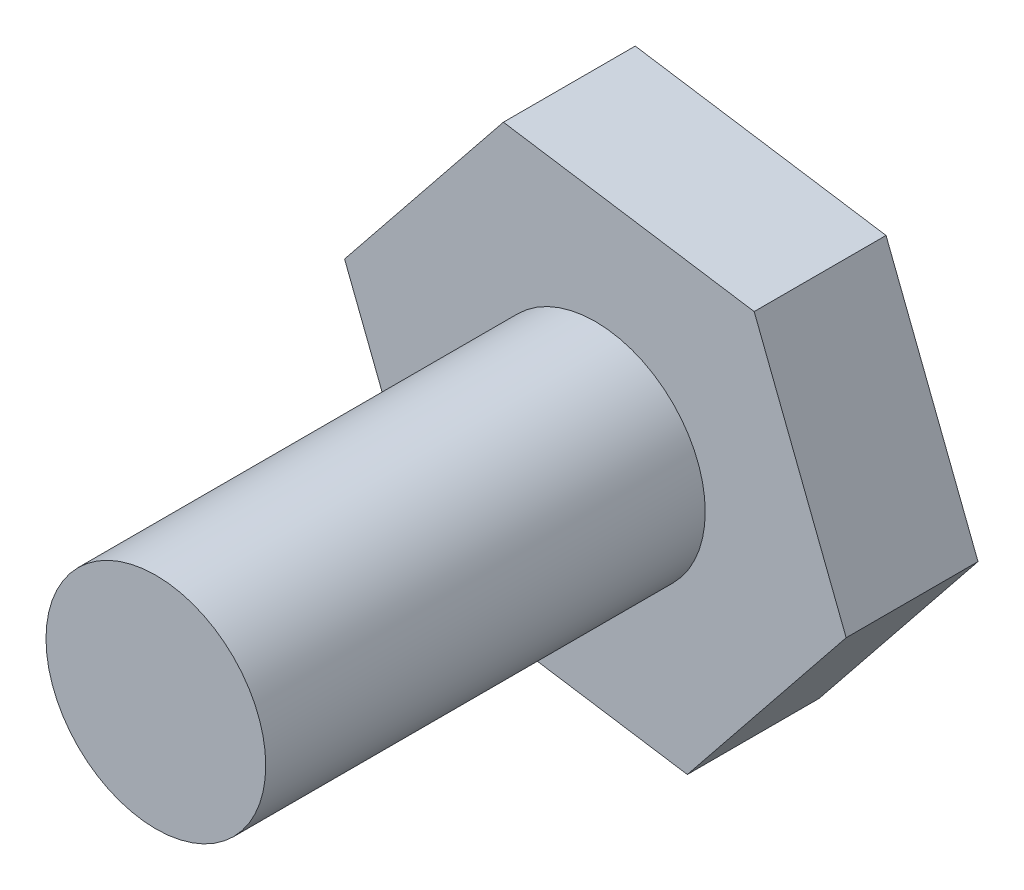
ISO-10303-21;
HEADER;
FILE_DESCRIPTION(('STEP AP214'),'2;1');
FILE_NAME('part.step','',(''),(''),'','','');
FILE_SCHEMA(('AUTOMOTIVE_DESIGN { 1 0 10303 214 1 1 1 1 }'));
ENDSEC;
DATA;
#1=APPLICATION_CONTEXT('core data for automotive mechanical design processes');
#2=APPLICATION_PROTOCOL_DEFINITION('international standard','automotive_design',2000,#1);
#3=PRODUCT_CONTEXT('',#1,'mechanical');
#4=PRODUCT('Part','Part','',(#3));
#5=PRODUCT_RELATED_PRODUCT_CATEGORY('part','',(#4));
#6=PRODUCT_DEFINITION_FORMATION('','',#4);
#7=PRODUCT_DEFINITION_CONTEXT('part definition',#1,'design');
#8=PRODUCT_DEFINITION('design','',#6,#7);
#9=PRODUCT_DEFINITION_SHAPE('','',#8);
#10=(LENGTH_UNIT() NAMED_UNIT(*) SI_UNIT(.MILLI.,.METRE.));
#11=(NAMED_UNIT(*) PLANE_ANGLE_UNIT() SI_UNIT($,.RADIAN.));
#12=(NAMED_UNIT(*) SI_UNIT($,.STERADIAN.) SOLID_ANGLE_UNIT());
#13=UNCERTAINTY_MEASURE_WITH_UNIT(LENGTH_MEASURE(1.E-05),#10,'distance_accuracy_value','');
#14=(GEOMETRIC_REPRESENTATION_CONTEXT(3) GLOBAL_UNCERTAINTY_ASSIGNED_CONTEXT((#13)) GLOBAL_UNIT_ASSIGNED_CONTEXT((#10,
#11,#12)) REPRESENTATION_CONTEXT('',''));
#15=CARTESIAN_POINT('',(0.,0.,0.));
#16=DIRECTION('',(0.,0.,1.));
#17=DIRECTION('',(1.,0.,0.));
#18=AXIS2_PLACEMENT_3D('',#15,#16,#17);
#19=CARTESIAN_POINT('',(0.,0.,3.));
#20=DIRECTION('',(0.,0.,1.));
#21=DIRECTION('',(1.,0.,0.));
#22=AXIS2_PLACEMENT_3D('',#19,#20,#21);
#23=PLANE('',#22);
#24=DIRECTION('',(0.98836285257801,-0.152114666103763,0.));
#25=VECTOR('',#24,1.);
#26=CARTESIAN_POINT('',(-60.0929519376663,5.17809821649077,3.));
#27=LINE('',#26,#25);
#28=CARTESIAN_POINT('',(-60.0929519376663,5.17809821649077,3.));
#29=VERTEX_POINT('',#28);
#30=CARTESIAN_POINT('',(-54.3866363477368,4.2998637822638,3.));
#31=VERTEX_POINT('',#30);
#32=EDGE_CURVE('E129',#29,#31,#27,.T.);
#33=ORIENTED_EDGE('',*,*,#32,.T.);
#34=DIRECTION('',(0.625916591423051,0.779890005437529,0.));
#35=VECTOR('',#34,1.);
#36=CARTESIAN_POINT('',(-54.3866363477368,4.2998637822638,3.));
#37=LINE('',#36,#35);
#38=CARTESIAN_POINT('',(-50.7729052222533,8.80256082804037,3.));
#39=VERTEX_POINT('',#38);
#40=EDGE_CURVE('E87',#31,#39,#37,.T.);
#41=ORIENTED_EDGE('',*,*,#40,.T.);
#42=DIRECTION('',(-0.362446261154959,0.932004671541292,0.));
#43=VECTOR('',#42,1.);
#44=CARTESIAN_POINT('',(-50.7729052222533,8.80256082804037,3.));
#45=LINE('',#44,#43);
#46=CARTESIAN_POINT('',(-52.8654896866992,14.1834923080439,3.));
#47=VERTEX_POINT('',#46);
#48=EDGE_CURVE('E100',#39,#47,#45,.T.);
#49=ORIENTED_EDGE('',*,*,#48,.T.);
#50=DIRECTION('',(-0.98836285257801,0.152114666103762,0.));
#51=VECTOR('',#50,1.);
#52=CARTESIAN_POINT('',(-52.8654896866992,14.1834923080439,3.));
#53=LINE('',#52,#51);
#54=CARTESIAN_POINT('',(-58.5718052766286,15.0617267422709,3.));
#55=VERTEX_POINT('',#54);
#56=EDGE_CURVE('E94',#47,#55,#53,.T.);
#57=ORIENTED_EDGE('',*,*,#56,.T.);
#58=DIRECTION('',(-0.625916591423051,-0.779890005437529,0.));
#59=VECTOR('',#58,1.);
#60=CARTESIAN_POINT('',(-58.5718052766286,15.0617267422709,3.));
#61=LINE('',#60,#59);
#62=CARTESIAN_POINT('',(-62.1855364021122,10.5590296964943,3.));
#63=VERTEX_POINT('',#62);
#64=EDGE_CURVE('E98',#55,#63,#61,.T.);
#65=ORIENTED_EDGE('',*,*,#64,.T.);
#66=DIRECTION('',(0.362446261154959,-0.932004671541292,0.));
#67=VECTOR('',#66,1.);
#68=CARTESIAN_POINT('',(-62.1855364021122,10.5590296964943,3.));
#69=LINE('',#68,#67);
#70=EDGE_CURVE('E50',#63,#29,#69,.T.);
#71=ORIENTED_EDGE('',*,*,#70,.T.);
#72=EDGE_LOOP('',(#33,#41,#49,#57,#65,#71));
#73=FACE_BOUND('',#72,.T.);
#74=CARTESIAN_POINT('',(-56.4792208121828,9.68079526226739,3.));
#75=DIRECTION('',(0.,0.,1.));
#76=DIRECTION('',(1.,0.,0.));
#77=AXIS2_PLACEMENT_3D('',#74,#75,#76);
#78=CIRCLE('',#77,2.5);
#79=CARTESIAN_POINT('',(-53.9792208121828,9.68079526226739,3.));
#80=VERTEX_POINT('',#79);
#81=EDGE_CURVE('E122',#80,#80,#78,.F.);
#82=ORIENTED_EDGE('',*,*,#81,.T.);
#83=EDGE_LOOP('',(#82));
#84=FACE_BOUND('',#83,.T.);
#85=ADVANCED_FACE('F33',(#73,#84),#23,.T.);
#86=CARTESIAN_POINT('',(-60.0929519376663,5.17809821649077,3.));
#87=DIRECTION('',(0.152114666103763,0.98836285257801,0.));
#88=DIRECTION('',(-0.98836285257801,0.152114666103763,0.));
#89=AXIS2_PLACEMENT_3D('',#86,#87,#88);
#90=PLANE('',#89);
#91=DIRECTION('',(0.98836285257801,-0.152114666103763,0.));
#92=VECTOR('',#91,1.);
#93=CARTESIAN_POINT('',(-60.0929519376663,5.17809821649077,0.));
#94=LINE('',#93,#92);
#95=CARTESIAN_POINT('',(-60.0929519376663,5.17809821649077,0.));
#96=VERTEX_POINT('',#95);
#97=CARTESIAN_POINT('',(-54.3866363477368,4.2998637822638,0.));
#98=VERTEX_POINT('',#97);
#99=EDGE_CURVE('E118',#96,#98,#94,.T.);
#100=ORIENTED_EDGE('',*,*,#99,.T.);
#101=DIRECTION('',(0.,0.,-1.));
#102=VECTOR('',#101,1.);
#103=CARTESIAN_POINT('',(-54.3866363477368,4.2998637822638,3.));
#104=LINE('',#103,#102);
#105=EDGE_CURVE('E11',#31,#98,#104,.T.);
#106=ORIENTED_EDGE('',*,*,#105,.F.);
#107=ORIENTED_EDGE('',*,*,#32,.F.);
#108=DIRECTION('',(0.,0.,-1.));
#109=VECTOR('',#108,1.);
#110=CARTESIAN_POINT('',(-60.0929519376663,5.17809821649077,3.));
#111=LINE('',#110,#109);
#112=EDGE_CURVE('E114',#29,#96,#111,.T.);
#113=ORIENTED_EDGE('',*,*,#112,.T.);
#114=EDGE_LOOP('',(#100,#106,#107,#113));
#115=FACE_BOUND('',#114,.T.);
#116=ADVANCED_FACE('F35',(#115),#90,.F.);
#117=CARTESIAN_POINT('',(-54.3866363477368,4.2998637822638,3.));
#118=DIRECTION('',(-0.779890005437529,0.625916591423051,0.));
#119=DIRECTION('',(-0.625916591423052,-0.779890005437529,0.));
#120=AXIS2_PLACEMENT_3D('',#117,#118,#119);
#121=PLANE('',#120);
#122=DIRECTION('',(0.625916591423051,0.779890005437529,0.));
#123=VECTOR('',#122,1.);
#124=CARTESIAN_POINT('',(-54.3866363477368,4.2998637822638,0.));
#125=LINE('',#124,#123);
#126=CARTESIAN_POINT('',(-50.7729052222533,8.80256082804037,0.));
#127=VERTEX_POINT('',#126);
#128=EDGE_CURVE('E121',#98,#127,#125,.T.);
#129=ORIENTED_EDGE('',*,*,#128,.T.);
#130=DIRECTION('',(0.,0.,-1.));
#131=VECTOR('',#130,1.);
#132=CARTESIAN_POINT('',(-50.7729052222533,8.80256082804037,3.));
#133=LINE('',#132,#131);
#134=EDGE_CURVE('E42',#39,#127,#133,.T.);
#135=ORIENTED_EDGE('',*,*,#134,.F.);
#136=ORIENTED_EDGE('',*,*,#40,.F.);
#137=ORIENTED_EDGE('',*,*,#105,.T.);
#138=EDGE_LOOP('',(#129,#135,#136,#137));
#139=FACE_BOUND('',#138,.T.);
#140=ADVANCED_FACE('F157',(#139),#121,.F.);
#141=CARTESIAN_POINT('',(-50.7729052222533,8.80256082804037,3.));
#142=DIRECTION('',(-0.932004671541292,-0.362446261154959,0.));
#143=DIRECTION('',(0.362446261154959,-0.932004671541292,0.));
#144=AXIS2_PLACEMENT_3D('',#141,#142,#143);
#145=PLANE('',#144);
#146=DIRECTION('',(-0.362446261154959,0.932004671541292,0.));
#147=VECTOR('',#146,1.);
#148=CARTESIAN_POINT('',(-50.7729052222533,8.80256082804037,0.));
#149=LINE('',#148,#147);
#150=CARTESIAN_POINT('',(-52.8654896866992,14.1834923080439,0.));
#151=VERTEX_POINT('',#150);
#152=EDGE_CURVE('E124',#127,#151,#149,.T.);
#153=ORIENTED_EDGE('',*,*,#152,.T.);
#154=DIRECTION('',(0.,0.,-1.));
#155=VECTOR('',#154,1.);
#156=CARTESIAN_POINT('',(-52.8654896866992,14.1834923080439,3.));
#157=LINE('',#156,#155);
#158=EDGE_CURVE('E109',#47,#151,#157,.T.);
#159=ORIENTED_EDGE('',*,*,#158,.F.);
#160=ORIENTED_EDGE('',*,*,#48,.F.);
#161=ORIENTED_EDGE('',*,*,#134,.T.);
#162=EDGE_LOOP('',(#153,#159,#160,#161));
#163=FACE_BOUND('',#162,.T.);
#164=ADVANCED_FACE('F135',(#163),#145,.F.);
#165=CARTESIAN_POINT('',(-52.8654896866992,14.1834923080439,3.));
#166=DIRECTION('',(-0.152114666103762,-0.98836285257801,0.));
#167=DIRECTION('',(0.98836285257801,-0.152114666103762,0.));
#168=AXIS2_PLACEMENT_3D('',#165,#166,#167);
#169=PLANE('',#168);
#170=DIRECTION('',(-0.98836285257801,0.152114666103762,0.));
#171=VECTOR('',#170,1.);
#172=CARTESIAN_POINT('',(-52.8654896866992,14.1834923080439,0.));
#173=LINE('',#172,#171);
#174=CARTESIAN_POINT('',(-58.5718052766286,15.0617267422709,0.));
#175=VERTEX_POINT('',#174);
#176=EDGE_CURVE('E108',#151,#175,#173,.T.);
#177=ORIENTED_EDGE('',*,*,#176,.T.);
#178=DIRECTION('',(0.,0.,-1.));
#179=VECTOR('',#178,1.);
#180=CARTESIAN_POINT('',(-58.5718052766286,15.0617267422709,3.));
#181=LINE('',#180,#179);
#182=EDGE_CURVE('E105',#55,#175,#181,.T.);
#183=ORIENTED_EDGE('',*,*,#182,.F.);
#184=ORIENTED_EDGE('',*,*,#56,.F.);
#185=ORIENTED_EDGE('',*,*,#158,.T.);
#186=EDGE_LOOP('',(#177,#183,#184,#185));
#187=FACE_BOUND('',#186,.T.);
#188=ADVANCED_FACE('F106',(#187),#169,.F.);
#189=CARTESIAN_POINT('',(-58.5718052766286,15.0617267422709,3.));
#190=DIRECTION('',(0.779890005437529,-0.625916591423051,0.));
#191=DIRECTION('',(0.625916591423051,0.779890005437529,0.));
#192=AXIS2_PLACEMENT_3D('',#189,#190,#191);
#193=PLANE('',#192);
#194=DIRECTION('',(-0.625916591423051,-0.779890005437529,0.));
#195=VECTOR('',#194,1.);
#196=CARTESIAN_POINT('',(-58.5718052766286,15.0617267422709,0.));
#197=LINE('',#196,#195);
#198=CARTESIAN_POINT('',(-62.1855364021122,10.5590296964943,0.));
#199=VERTEX_POINT('',#198);
#200=EDGE_CURVE('E73',#175,#199,#197,.T.);
#201=ORIENTED_EDGE('',*,*,#200,.T.);
#202=DIRECTION('',(0.,0.,-1.));
#203=VECTOR('',#202,1.);
#204=CARTESIAN_POINT('',(-62.1855364021122,10.5590296964943,3.));
#205=LINE('',#204,#203);
#206=EDGE_CURVE('E110',#63,#199,#205,.T.);
#207=ORIENTED_EDGE('',*,*,#206,.F.);
#208=ORIENTED_EDGE('',*,*,#64,.F.);
#209=ORIENTED_EDGE('',*,*,#182,.T.);
#210=EDGE_LOOP('',(#201,#207,#208,#209));
#211=FACE_BOUND('',#210,.T.);
#212=ADVANCED_FACE('F112',(#211),#193,.F.);
#213=CARTESIAN_POINT('',(-62.1855364021122,10.5590296964943,3.));
#214=DIRECTION('',(0.932004671541292,0.362446261154959,0.));
#215=DIRECTION('',(-0.362446261154959,0.932004671541292,0.));
#216=AXIS2_PLACEMENT_3D('',#213,#214,#215);
#217=PLANE('',#216);
#218=DIRECTION('',(0.362446261154959,-0.932004671541292,0.));
#219=VECTOR('',#218,1.);
#220=CARTESIAN_POINT('',(-62.1855364021122,10.5590296964943,0.));
#221=LINE('',#220,#219);
#222=EDGE_CURVE('E79',#199,#96,#221,.T.);
#223=ORIENTED_EDGE('',*,*,#222,.T.);
#224=ORIENTED_EDGE('',*,*,#112,.F.);
#225=ORIENTED_EDGE('',*,*,#70,.F.);
#226=ORIENTED_EDGE('',*,*,#206,.T.);
#227=EDGE_LOOP('',(#223,#224,#225,#226));
#228=FACE_BOUND('',#227,.T.);
#229=ADVANCED_FACE('F142',(#228),#217,.F.);
#230=CARTESIAN_POINT('',(0.,0.,0.));
#231=DIRECTION('',(0.,0.,1.));
#232=DIRECTION('',(1.,0.,0.));
#233=AXIS2_PLACEMENT_3D('',#230,#231,#232);
#234=PLANE('',#233);
#235=ORIENTED_EDGE('',*,*,#99,.F.);
#236=ORIENTED_EDGE('',*,*,#222,.F.);
#237=ORIENTED_EDGE('',*,*,#200,.F.);
#238=ORIENTED_EDGE('',*,*,#176,.F.);
#239=ORIENTED_EDGE('',*,*,#152,.F.);
#240=ORIENTED_EDGE('',*,*,#128,.F.);
#241=EDGE_LOOP('',(#235,#236,#237,#238,#239,#240));
#242=FACE_BOUND('',#241,.T.);
#243=ADVANCED_FACE('F138',(#242),#234,.F.);
#244=CARTESIAN_POINT('',(-56.4792208121828,9.68079526226739,13.));
#245=DIRECTION('',(0.,0.,-1.));
#246=DIRECTION('',(-1.,0.,0.));
#247=AXIS2_PLACEMENT_3D('',#244,#245,#246);
#248=CYLINDRICAL_SURFACE('',#247,2.5);
#249=ORIENTED_EDGE('',*,*,#81,.F.);
#250=EDGE_LOOP('',(#249));
#251=FACE_BOUND('',#250,.T.);
#252=CARTESIAN_POINT('',(-56.4792208121828,9.68079526226739,13.));
#253=DIRECTION('',(0.,0.,1.));
#254=DIRECTION('',(1.,0.,0.));
#255=AXIS2_PLACEMENT_3D('',#252,#253,#254);
#256=CIRCLE('',#255,2.5);
#257=CARTESIAN_POINT('',(-53.9792208121828,9.68079526226739,13.));
#258=VERTEX_POINT('',#257);
#259=EDGE_CURVE('E169',#258,#258,#256,.T.);
#260=ORIENTED_EDGE('',*,*,#259,.F.);
#261=EDGE_LOOP('',(#260));
#262=FACE_BOUND('',#261,.T.);
#263=ADVANCED_FACE('F149',(#251,#262),#248,.T.);
#264=CARTESIAN_POINT('',(-56.4792208121828,9.68079526226739,13.));
#265=DIRECTION('',(0.,0.,1.));
#266=DIRECTION('',(1.,0.,0.));
#267=AXIS2_PLACEMENT_3D('',#264,#265,#266);
#268=PLANE('',#267);
#269=ORIENTED_EDGE('',*,*,#259,.T.);
#270=EDGE_LOOP('',(#269));
#271=FACE_BOUND('',#270,.T.);
#272=ADVANCED_FACE('F161',(#271),#268,.T.);
#273=CLOSED_SHELL('',(#85,#116,#140,#164,#188,#212,#229,#243,#263,#272));
#274=MANIFOLD_SOLID_BREP('B2',#273);
#275=ADVANCED_BREP_SHAPE_REPRESENTATION('',(#18,#274),#14);
#276=SHAPE_DEFINITION_REPRESENTATION(#9,#275);
ENDSEC;
END-ISO-10303-21;
